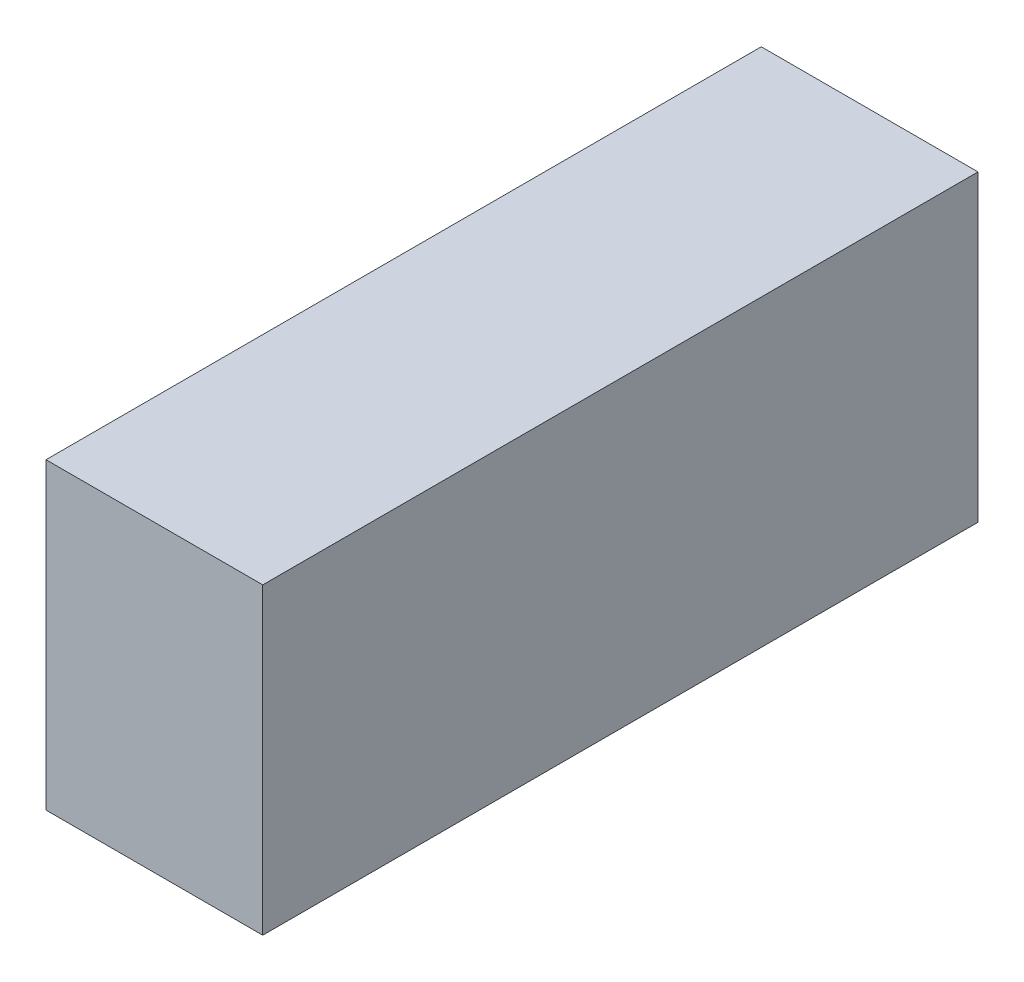
ISO-10303-21;
HEADER;
FILE_DESCRIPTION(('STEP AP214'),'2;1');
FILE_NAME('part.step','',(''),(''),'','','');
FILE_SCHEMA(('AUTOMOTIVE_DESIGN { 1 0 10303 214 1 1 1 1 }'));
ENDSEC;
DATA;
#1=APPLICATION_CONTEXT('core data for automotive mechanical design processes');
#2=APPLICATION_PROTOCOL_DEFINITION('international standard','automotive_design',2000,#1);
#3=PRODUCT_CONTEXT('',#1,'mechanical');
#4=PRODUCT('Part','Part','',(#3));
#5=PRODUCT_RELATED_PRODUCT_CATEGORY('part','',(#4));
#6=PRODUCT_DEFINITION_FORMATION('','',#4);
#7=PRODUCT_DEFINITION_CONTEXT('part definition',#1,'design');
#8=PRODUCT_DEFINITION('design','',#6,#7);
#9=PRODUCT_DEFINITION_SHAPE('','',#8);
#10=(LENGTH_UNIT() NAMED_UNIT(*) SI_UNIT(.MILLI.,.METRE.));
#11=(NAMED_UNIT(*) PLANE_ANGLE_UNIT() SI_UNIT($,.RADIAN.));
#12=(NAMED_UNIT(*) SI_UNIT($,.STERADIAN.) SOLID_ANGLE_UNIT());
#13=UNCERTAINTY_MEASURE_WITH_UNIT(LENGTH_MEASURE(1.E-05),#10,'distance_accuracy_value','');
#14=(GEOMETRIC_REPRESENTATION_CONTEXT(3) GLOBAL_UNCERTAINTY_ASSIGNED_CONTEXT((#13)) GLOBAL_UNIT_ASSIGNED_CONTEXT((#10,
#11,#12)) REPRESENTATION_CONTEXT('',''));
#15=CARTESIAN_POINT('',(0.,0.,0.));
#16=DIRECTION('',(0.,0.,1.));
#17=DIRECTION('',(1.,0.,0.));
#18=AXIS2_PLACEMENT_3D('',#15,#16,#17);
#19=CARTESIAN_POINT('',(1.27,1.778,0.));
#20=DIRECTION('',(1.,0.,0.));
#21=DIRECTION('',(0.,0.,-1.));
#22=AXIS2_PLACEMENT_3D('',#19,#20,#21);
#23=PLANE('',#22);
#24=DIRECTION('',(0.,0.,-1.));
#25=VECTOR('',#24,1.);
#26=CARTESIAN_POINT('',(1.27,-1.778,0.));
#27=LINE('',#26,#25);
#28=CARTESIAN_POINT('',(1.27,-1.778,0.));
#29=VERTEX_POINT('',#28);
#30=CARTESIAN_POINT('',(1.27,-1.778,8.382));
#31=VERTEX_POINT('',#30);
#32=EDGE_CURVE('E19',#29,#31,#27,.F.);
#33=ORIENTED_EDGE('',*,*,#32,.F.);
#34=DIRECTION('',(0.,1.,0.));
#35=VECTOR('',#34,1.);
#36=CARTESIAN_POINT('',(1.27,-1.778,0.));
#37=LINE('',#36,#35);
#38=CARTESIAN_POINT('',(1.27,1.778,0.));
#39=VERTEX_POINT('',#38);
#40=EDGE_CURVE('E79',#29,#39,#37,.T.);
#41=ORIENTED_EDGE('',*,*,#40,.T.);
#42=DIRECTION('',(0.,0.,1.));
#43=VECTOR('',#42,1.);
#44=CARTESIAN_POINT('',(1.27,1.778,0.));
#45=LINE('',#44,#43);
#46=CARTESIAN_POINT('',(1.27,1.778,8.382));
#47=VERTEX_POINT('',#46);
#48=EDGE_CURVE('E67',#47,#39,#45,.F.);
#49=ORIENTED_EDGE('',*,*,#48,.F.);
#50=DIRECTION('',(0.,1.,0.));
#51=VECTOR('',#50,1.);
#52=CARTESIAN_POINT('',(1.27,-1.778,8.382));
#53=LINE('',#52,#51);
#54=EDGE_CURVE('E55',#31,#47,#53,.T.);
#55=ORIENTED_EDGE('',*,*,#54,.F.);
#56=EDGE_LOOP('',(#33,#41,#49,#55));
#57=FACE_BOUND('',#56,.T.);
#58=ADVANCED_FACE('F16',(#57),#23,.T.);
#59=CARTESIAN_POINT('',(1.27,-1.778,0.));
#60=DIRECTION('',(0.,-1.,0.));
#61=DIRECTION('',(0.,0.,-1.));
#62=AXIS2_PLACEMENT_3D('',#59,#60,#61);
#63=PLANE('',#62);
#64=DIRECTION('',(0.,0.,1.));
#65=VECTOR('',#64,1.);
#66=CARTESIAN_POINT('',(-1.27,-1.778,0.));
#67=LINE('',#66,#65);
#68=CARTESIAN_POINT('',(-1.27,-1.778,0.));
#69=VERTEX_POINT('',#68);
#70=CARTESIAN_POINT('',(-1.27,-1.778,8.382));
#71=VERTEX_POINT('',#70);
#72=EDGE_CURVE('E82',#69,#71,#67,.T.);
#73=ORIENTED_EDGE('',*,*,#72,.F.);
#74=DIRECTION('',(1.,0.,0.));
#75=VECTOR('',#74,1.);
#76=CARTESIAN_POINT('',(-1.27,-1.778,0.));
#77=LINE('',#76,#75);
#78=EDGE_CURVE('E64',#69,#29,#77,.T.);
#79=ORIENTED_EDGE('',*,*,#78,.T.);
#80=ORIENTED_EDGE('',*,*,#32,.T.);
#81=DIRECTION('',(1.,0.,0.));
#82=VECTOR('',#81,1.);
#83=CARTESIAN_POINT('',(-1.27,-1.778,8.382));
#84=LINE('',#83,#82);
#85=EDGE_CURVE('E61',#71,#31,#84,.T.);
#86=ORIENTED_EDGE('',*,*,#85,.F.);
#87=EDGE_LOOP('',(#73,#79,#80,#86));
#88=FACE_BOUND('',#87,.T.);
#89=ADVANCED_FACE('F60',(#88),#63,.T.);
#90=CARTESIAN_POINT('',(-1.27,-1.778,8.382));
#91=DIRECTION('',(0.,0.,1.));
#92=DIRECTION('',(1.,0.,0.));
#93=AXIS2_PLACEMENT_3D('',#90,#91,#92);
#94=PLANE('',#93);
#95=DIRECTION('',(1.,0.,0.));
#96=VECTOR('',#95,1.);
#97=CARTESIAN_POINT('',(-1.27,1.778,8.382));
#98=LINE('',#97,#96);
#99=CARTESIAN_POINT('',(-1.27,1.778,8.382));
#100=VERTEX_POINT('',#99);
#101=EDGE_CURVE('E69',#100,#47,#98,.T.);
#102=ORIENTED_EDGE('',*,*,#101,.F.);
#103=DIRECTION('',(0.,1.,0.));
#104=VECTOR('',#103,1.);
#105=CARTESIAN_POINT('',(-1.27,-1.778,8.382));
#106=LINE('',#105,#104);
#107=EDGE_CURVE('E73',#71,#100,#106,.T.);
#108=ORIENTED_EDGE('',*,*,#107,.F.);
#109=ORIENTED_EDGE('',*,*,#85,.T.);
#110=ORIENTED_EDGE('',*,*,#54,.T.);
#111=EDGE_LOOP('',(#102,#108,#109,#110));
#112=FACE_BOUND('',#111,.T.);
#113=ADVANCED_FACE('F71',(#112),#94,.T.);
#114=CARTESIAN_POINT('',(-1.27,1.778,0.));
#115=DIRECTION('',(0.,1.,0.));
#116=DIRECTION('',(0.,0.,1.));
#117=AXIS2_PLACEMENT_3D('',#114,#115,#116);
#118=PLANE('',#117);
#119=ORIENTED_EDGE('',*,*,#48,.T.);
#120=DIRECTION('',(1.,0.,0.));
#121=VECTOR('',#120,1.);
#122=CARTESIAN_POINT('',(-1.27,1.778,0.));
#123=LINE('',#122,#121);
#124=CARTESIAN_POINT('',(-1.27,1.778,0.));
#125=VERTEX_POINT('',#124);
#126=EDGE_CURVE('E34',#39,#125,#123,.F.);
#127=ORIENTED_EDGE('',*,*,#126,.T.);
#128=DIRECTION('',(0.,0.,1.));
#129=VECTOR('',#128,1.);
#130=CARTESIAN_POINT('',(-1.27,1.778,0.));
#131=LINE('',#130,#129);
#132=EDGE_CURVE('E25',#100,#125,#131,.F.);
#133=ORIENTED_EDGE('',*,*,#132,.F.);
#134=ORIENTED_EDGE('',*,*,#101,.T.);
#135=EDGE_LOOP('',(#119,#127,#133,#134));
#136=FACE_BOUND('',#135,.T.);
#137=ADVANCED_FACE('F88',(#136),#118,.T.);
#138=CARTESIAN_POINT('',(-1.27,-1.778,0.));
#139=DIRECTION('',(0.,0.,1.));
#140=DIRECTION('',(1.,0.,0.));
#141=AXIS2_PLACEMENT_3D('',#138,#139,#140);
#142=PLANE('',#141);
#143=ORIENTED_EDGE('',*,*,#126,.F.);
#144=ORIENTED_EDGE('',*,*,#40,.F.);
#145=ORIENTED_EDGE('',*,*,#78,.F.);
#146=DIRECTION('',(0.,1.,0.));
#147=VECTOR('',#146,1.);
#148=CARTESIAN_POINT('',(-1.27,-1.778,0.));
#149=LINE('',#148,#147);
#150=EDGE_CURVE('E11',#125,#69,#149,.F.);
#151=ORIENTED_EDGE('',*,*,#150,.F.);
#152=EDGE_LOOP('',(#143,#144,#145,#151));
#153=FACE_BOUND('',#152,.T.);
#154=ADVANCED_FACE('F90',(#153),#142,.F.);
#155=CARTESIAN_POINT('',(-1.27,-1.778,0.));
#156=DIRECTION('',(-1.,0.,0.));
#157=DIRECTION('',(0.,0.,1.));
#158=AXIS2_PLACEMENT_3D('',#155,#156,#157);
#159=PLANE('',#158);
#160=ORIENTED_EDGE('',*,*,#132,.T.);
#161=ORIENTED_EDGE('',*,*,#150,.T.);
#162=ORIENTED_EDGE('',*,*,#72,.T.);
#163=ORIENTED_EDGE('',*,*,#107,.T.);
#164=EDGE_LOOP('',(#160,#161,#162,#163));
#165=FACE_BOUND('',#164,.T.);
#166=ADVANCED_FACE('F87',(#165),#159,.T.);
#167=CLOSED_SHELL('',(#58,#89,#113,#137,#154,#166));
#168=MANIFOLD_SOLID_BREP('B1',#167);
#169=ADVANCED_BREP_SHAPE_REPRESENTATION('',(#18,#168),#14);
#170=SHAPE_DEFINITION_REPRESENTATION(#9,#169);
ENDSEC;
END-ISO-10303-21;
